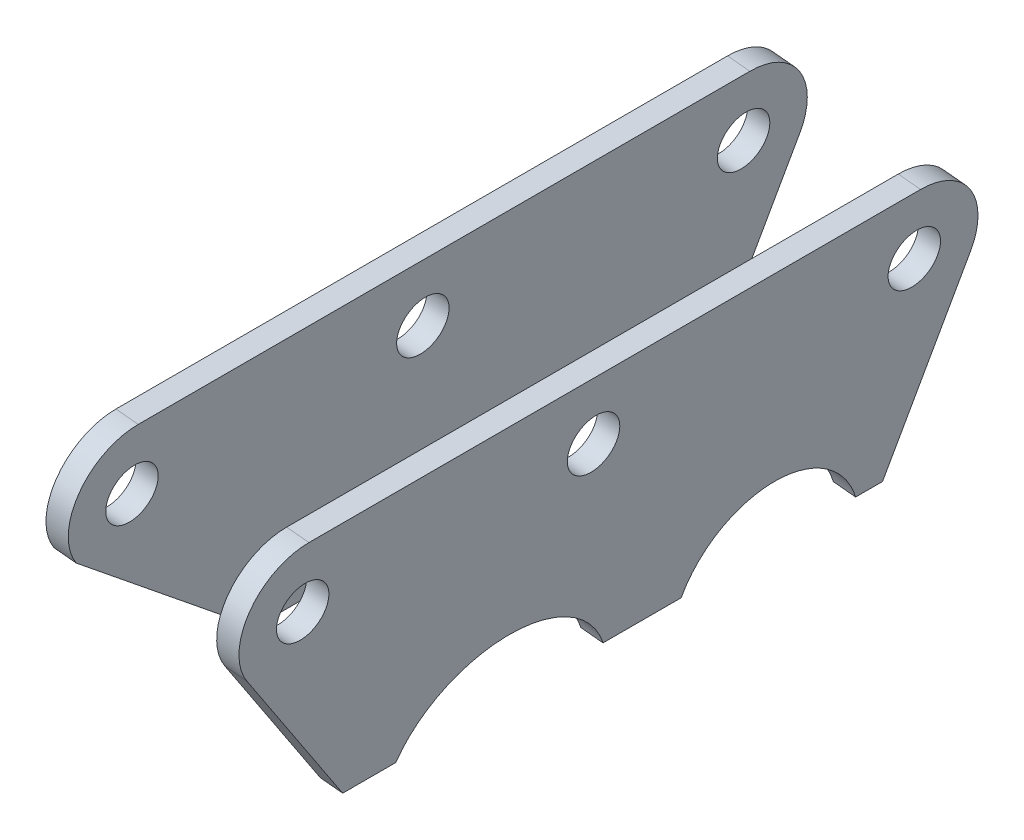
ISO-10303-21;
HEADER;
FILE_DESCRIPTION(('STEP AP214'),'2;1');
FILE_NAME('part.step','',(''),(''),'','','');
FILE_SCHEMA(('AUTOMOTIVE_DESIGN { 1 0 10303 214 1 1 1 1 }'));
ENDSEC;
DATA;
#1=APPLICATION_CONTEXT('core data for automotive mechanical design processes');
#2=APPLICATION_PROTOCOL_DEFINITION('international standard','automotive_design',2000,#1);
#3=PRODUCT_CONTEXT('',#1,'mechanical');
#4=PRODUCT('Part','Part','',(#3));
#5=PRODUCT_RELATED_PRODUCT_CATEGORY('part','',(#4));
#6=PRODUCT_DEFINITION_FORMATION('','',#4);
#7=PRODUCT_DEFINITION_CONTEXT('part definition',#1,'design');
#8=PRODUCT_DEFINITION('design','',#6,#7);
#9=PRODUCT_DEFINITION_SHAPE('','',#8);
#10=(LENGTH_UNIT() NAMED_UNIT(*) SI_UNIT(.MILLI.,.METRE.));
#11=(NAMED_UNIT(*) PLANE_ANGLE_UNIT() SI_UNIT($,.RADIAN.));
#12=(NAMED_UNIT(*) SI_UNIT($,.STERADIAN.) SOLID_ANGLE_UNIT());
#13=UNCERTAINTY_MEASURE_WITH_UNIT(LENGTH_MEASURE(1.E-05),#10,'distance_accuracy_value','');
#14=(GEOMETRIC_REPRESENTATION_CONTEXT(3) GLOBAL_UNCERTAINTY_ASSIGNED_CONTEXT((#13)) GLOBAL_UNIT_ASSIGNED_CONTEXT((#10,
#11,#12)) REPRESENTATION_CONTEXT('',''));
#15=CARTESIAN_POINT('',(0.,0.,0.));
#16=DIRECTION('',(0.,0.,1.));
#17=DIRECTION('',(1.,0.,0.));
#18=AXIS2_PLACEMENT_3D('',#15,#16,#17);
#19=CARTESIAN_POINT('',(1518.55335235882,195.979858268925,120.38052420687));
#20=CARTESIAN_POINT('',(1517.30151080177,183.389398509062,130.879563749731));
#21=CARTESIAN_POINT('',(1517.70411522621,187.438612865733,147.781567533865));
#22=CARTESIAN_POINT('',(1519.194517135,202.428405426136,147.2976885881));
#23=CARTESIAN_POINT('',(1520.68491904379,217.418197986539,146.813809642336));
#24=CARTESIAN_POINT('',(1521.16544153503,222.251077240006,129.62508687427));
#25=CARTESIAN_POINT('',(1519.95976976722,210.124972469999,119.923911954249));
#26=(BOUNDED_CURVE() B_SPLINE_CURVE(3,(#19,#20,#21,#22,#23,#24,#25),.UNSPECIFIED.,.F.,
.F.) B_SPLINE_CURVE_WITH_KNOTS((4,3,4),(0.,0.5,1.),
.UNSPECIFIED.) CURVE() GEOMETRIC_REPRESENTATION_ITEM() RATIONAL_B_SPLINE_CURVE((1.,
0.530847598998818,0.530847598998818,1.,0.530847598998818,0.530847598998818,1.)) REPRESENTATION_ITEM(''));
#27=DIRECTION('',(0.995093407225825,-0.098939935797927,0.));
#28=VECTOR('',#27,1.);
#29=SURFACE_OF_LINEAR_EXTRUSION('',#26,#28);
#30=CARTESIAN_POINT('',(1521.5386325805,195.683038461532,120.38052420687));
#31=CARTESIAN_POINT('',(1520.28679102345,183.092578701669,130.879563749731));
#32=CARTESIAN_POINT('',(1520.68939544789,187.141793058339,147.781567533865));
#33=CARTESIAN_POINT('',(1522.17979735668,202.131585618742,147.2976885881));
#34=CARTESIAN_POINT('',(1523.67019926546,217.121378179145,146.813809642336));
#35=CARTESIAN_POINT('',(1524.1507217567,221.954257432612,129.62508687427));
#36=CARTESIAN_POINT('',(1522.9450499889,209.828152662605,119.923911954249));
#37=(BOUNDED_CURVE() B_SPLINE_CURVE(3,(#30,#31,#32,#33,#34,#35,#36),.UNSPECIFIED.,.F.,
.F.) B_SPLINE_CURVE_WITH_KNOTS((4,3,4),(0.,0.5,1.),
.UNSPECIFIED.) CURVE() GEOMETRIC_REPRESENTATION_ITEM() RATIONAL_B_SPLINE_CURVE((1.,
0.530847598998818,0.530847598998818,1.,0.530847598998818,0.530847598998818,1.)) REPRESENTATION_ITEM(''));
#38=CARTESIAN_POINT('',(1522.4271576291,204.619424066495,146.921435672186));
#39=VERTEX_POINT('',#38);
#40=CARTESIAN_POINT('',(1522.9450499889,209.828152662605,119.923911954249));
#41=VERTEX_POINT('',#40);
#42=EDGE_CURVE('E158',#39,#41,#37,.T.);
#43=ORIENTED_EDGE('',*,*,#42,.F.);
#44=DIRECTION('',(0.995093407225825,-0.098939935797927,0.));
#45=VECTOR('',#44,1.);
#46=CARTESIAN_POINT('',(1519.44187740742,204.916243873889,146.921435672186));
#47=LINE('',#46,#45);
#48=CARTESIAN_POINT('',(1519.44187740742,204.916243873889,146.921435672186));
#49=VERTEX_POINT('',#48);
#50=EDGE_CURVE('E12',#49,#39,#47,.T.);
#51=ORIENTED_EDGE('',*,*,#50,.F.);
#52=CARTESIAN_POINT('',(1519.95976976722,210.124972469999,119.923911954249));
#53=VERTEX_POINT('',#52);
#54=EDGE_CURVE('E203',#49,#53,#26,.T.);
#55=ORIENTED_EDGE('',*,*,#54,.T.);
#56=DIRECTION('',(0.995093407225825,-0.098939935797927,0.));
#57=VECTOR('',#56,1.);
#58=CARTESIAN_POINT('',(1519.95976976722,210.124972469999,119.923911954249));
#59=LINE('',#58,#57);
#60=EDGE_CURVE('E50',#53,#41,#59,.T.);
#61=ORIENTED_EDGE('',*,*,#60,.T.);
#62=EDGE_LOOP('',(#43,#51,#55,#61));
#63=FACE_BOUND('',#62,.T.);
#64=ADVANCED_FACE('F46',(#63),#29,.T.);
#65=CARTESIAN_POINT('',(1519.44187740742,204.91624387389,2.06594070866154E-12));
#66=DIRECTION('',(-0.098939935797927,-0.995093407225825,0.));
#67=DIRECTION('',(0.995093407225825,-0.098939935797927,0.));
#68=AXIS2_PLACEMENT_3D('',#65,#66,#67);
#69=PLANE('',#68);
#70=DIRECTION('',(0.,0.,-1.));
#71=VECTOR('',#70,1.);
#72=CARTESIAN_POINT('',(1522.4271576291,204.619424066496,2.06612481674144E-12));
#73=LINE('',#72,#71);
#74=CARTESIAN_POINT('',(1522.4271576291,204.619424066495,156.840444695534));
#75=VERTEX_POINT('',#74);
#76=EDGE_CURVE('E189',#75,#39,#73,.T.);
#77=ORIENTED_EDGE('',*,*,#76,.F.);
#78=DIRECTION('',(0.995093407225825,-0.098939935797927,0.));
#79=VECTOR('',#78,1.);
#80=CARTESIAN_POINT('',(1519.44187740742,204.916243873889,156.840444695534));
#81=LINE('',#80,#79);
#82=CARTESIAN_POINT('',(1519.44187740742,204.916243873889,156.840444695534));
#83=VERTEX_POINT('',#82);
#84=EDGE_CURVE('E56',#83,#75,#81,.T.);
#85=ORIENTED_EDGE('',*,*,#84,.F.);
#86=DIRECTION('',(0.,0.,-1.));
#87=VECTOR('',#86,1.);
#88=CARTESIAN_POINT('',(1519.44187740742,204.91624387389,2.06594070866154E-12));
#89=LINE('',#88,#87);
#90=EDGE_CURVE('E130',#83,#49,#89,.T.);
#91=ORIENTED_EDGE('',*,*,#90,.T.);
#92=ORIENTED_EDGE('',*,*,#50,.T.);
#93=EDGE_LOOP('',(#77,#85,#91,#92));
#94=FACE_BOUND('',#93,.T.);
#95=ADVANCED_FACE('F207',(#94),#69,.T.);
#96=CARTESIAN_POINT('',(1497.55241578868,-15.2381232061701,-110.194750627851));
#97=DIRECTION('',(0.0761883832681866,0.766268517216435,-0.637987374309168));
#98=DIRECTION('',(0.,0.639847127682288,0.768502214178154));
#99=AXIS2_PLACEMENT_3D('',#96,#97,#98);
#100=PLANE('',#99);
#101=DIRECTION('',(0.0631224298540366,0.634857030068368,0.770046823395885));
#102=VECTOR('',#101,1.);
#103=CARTESIAN_POINT('',(1500.53769601036,-15.5349430135639,-110.194750627851));
#104=LINE('',#103,#102);
#105=CARTESIAN_POINT('',(1524.57087184271,226.179938167708,182.992168009732));
#106=VERTEX_POINT('',#105);
#107=EDGE_CURVE('E134',#75,#106,#104,.T.);
#108=ORIENTED_EDGE('',*,*,#107,.T.);
#109=DIRECTION('',(0.995093407225825,-0.098939935797927,0.));
#110=VECTOR('',#109,1.);
#111=CARTESIAN_POINT('',(1521.58559162104,226.476757975102,182.992168009732));
#112=LINE('',#111,#110);
#113=CARTESIAN_POINT('',(1521.58559162104,226.476757975102,182.992168009732));
#114=VERTEX_POINT('',#113);
#115=EDGE_CURVE('E132',#114,#106,#112,.T.);
#116=ORIENTED_EDGE('',*,*,#115,.F.);
#117=DIRECTION('',(0.0631224298540366,0.634857030068368,0.770046823395885));
#118=VECTOR('',#117,1.);
#119=CARTESIAN_POINT('',(1497.55241578868,-15.2381232061701,-110.194750627851));
#120=LINE('',#119,#118);
#121=EDGE_CURVE('E125',#83,#114,#120,.T.);
#122=ORIENTED_EDGE('',*,*,#121,.F.);
#123=ORIENTED_EDGE('',*,*,#84,.T.);
#124=EDGE_LOOP('',(#108,#116,#122,#123));
#125=FACE_BOUND('',#124,.T.);
#126=ADVANCED_FACE('F133',(#125),#100,.F.);
#127=CARTESIAN_POINT('',(1522.06378570607,231.286219165373,176.));
#128=DIRECTION('',(0.995093407225825,-0.098939935797927,0.));
#129=DIRECTION('',(0.098939935797927,0.995093407225825,0.));
#130=AXIS2_PLACEMENT_3D('',#127,#128,#129);
#131=CYLINDRICAL_SURFACE('',#130,8.50000000000009);
#132=CARTESIAN_POINT('',(1525.04906592774,230.989399357979,176.));
#133=DIRECTION('',(0.995093407225826,-0.0989399357979263,0.));
#134=DIRECTION('',(0.0989399357979263,0.995093407225826,0.));
#135=AXIS2_PLACEMENT_3D('',#132,#133,#134);
#136=CIRCLE('',#135,8.50000000000009);
#137=CARTESIAN_POINT('',(1525.89005538203,239.447693319399,176.));
#138=VERTEX_POINT('',#137);
#139=EDGE_CURVE('E186',#138,#106,#136,.T.);
#140=ORIENTED_EDGE('',*,*,#139,.F.);
#141=DIRECTION('',(0.995093407225825,-0.098939935797927,0.));
#142=VECTOR('',#141,1.);
#143=CARTESIAN_POINT('',(1522.90477516035,239.744513126793,176.));
#144=LINE('',#143,#142);
#145=CARTESIAN_POINT('',(1522.90477516035,239.744513126793,176.));
#146=VERTEX_POINT('',#145);
#147=EDGE_CURVE('E138',#146,#138,#144,.T.);
#148=ORIENTED_EDGE('',*,*,#147,.F.);
#149=CARTESIAN_POINT('',(1522.06378570607,231.286219165373,176.));
#150=DIRECTION('',(0.995093407225826,-0.0989399357979263,0.));
#151=DIRECTION('',(0.0989399357979263,0.995093407225826,0.));
#152=AXIS2_PLACEMENT_3D('',#149,#150,#151);
#153=CIRCLE('',#152,8.50000000000009);
#154=EDGE_CURVE('E129',#146,#114,#153,.T.);
#155=ORIENTED_EDGE('',*,*,#154,.T.);
#156=ORIENTED_EDGE('',*,*,#115,.T.);
#157=EDGE_LOOP('',(#140,#148,#155,#156));
#158=FACE_BOUND('',#157,.T.);
#159=ADVANCED_FACE('F140',(#158),#131,.T.);
#160=CARTESIAN_POINT('',(1522.90477516035,239.744513126793,3.55372683172558E-13));
#161=DIRECTION('',(-0.098939935797927,-0.995093407225825,0.));
#162=DIRECTION('',(0.995093407225825,-0.098939935797927,0.));
#163=AXIS2_PLACEMENT_3D('',#160,#161,#162);
#164=PLANE('',#163);
#165=DIRECTION('',(0.,0.,-1.));
#166=VECTOR('',#165,1.);
#167=CARTESIAN_POINT('',(1525.89005538203,239.447693319399,3.55556791252454E-13));
#168=LINE('',#167,#166);
#169=CARTESIAN_POINT('',(1525.89005538203,239.447693319399,94.));
#170=VERTEX_POINT('',#169);
#171=EDGE_CURVE('E183',#138,#170,#168,.T.);
#172=ORIENTED_EDGE('',*,*,#171,.T.);
#173=DIRECTION('',(0.995093407225825,-0.098939935797927,0.));
#174=VECTOR('',#173,1.);
#175=CARTESIAN_POINT('',(1522.90477516035,239.744513126793,94.));
#176=LINE('',#175,#174);
#177=CARTESIAN_POINT('',(1522.90477516035,239.744513126793,94.));
#178=VERTEX_POINT('',#177);
#179=EDGE_CURVE('E195',#178,#170,#176,.T.);
#180=ORIENTED_EDGE('',*,*,#179,.F.);
#181=DIRECTION('',(0.,0.,-1.));
#182=VECTOR('',#181,1.);
#183=CARTESIAN_POINT('',(1522.90477516035,239.744513126793,3.55372683172558E-13));
#184=LINE('',#183,#182);
#185=EDGE_CURVE('E142',#146,#178,#184,.T.);
#186=ORIENTED_EDGE('',*,*,#185,.F.);
#187=ORIENTED_EDGE('',*,*,#147,.T.);
#188=EDGE_LOOP('',(#172,#180,#186,#187));
#189=FACE_BOUND('',#188,.T.);
#190=ADVANCED_FACE('F221',(#189),#164,.F.);
#191=CARTESIAN_POINT('',(1522.06378570607,231.286219165373,94.));
#192=DIRECTION('',(0.995093407225825,-0.098939935797927,0.));
#193=DIRECTION('',(0.098939935797927,0.995093407225825,0.));
#194=AXIS2_PLACEMENT_3D('',#191,#192,#193);
#195=CYLINDRICAL_SURFACE('',#194,8.50000000000013);
#196=CARTESIAN_POINT('',(1525.04906592774,230.989399357979,94.));
#197=DIRECTION('',(0.995093407225826,-0.0989399357979263,0.));
#198=DIRECTION('',(0.0989399357979263,0.995093407225826,0.));
#199=AXIS2_PLACEMENT_3D('',#196,#197,#198);
#200=CIRCLE('',#199,8.50000000000013);
#201=CARTESIAN_POINT('',(1524.73132954661,227.79374963824,86.1300021308239));
#202=VERTEX_POINT('',#201);
#203=EDGE_CURVE('E180',#202,#170,#200,.T.);
#204=ORIENTED_EDGE('',*,*,#203,.F.);
#205=DIRECTION('',(0.995093407225825,-0.098939935797927,0.));
#206=VECTOR('',#205,1.);
#207=CARTESIAN_POINT('',(1521.74604932493,228.090569445634,86.1300021308239));
#208=LINE('',#207,#206);
#209=CARTESIAN_POINT('',(1521.74604932493,228.090569445634,86.1300021308239));
#210=VERTEX_POINT('',#209);
#211=EDGE_CURVE('E197',#210,#202,#208,.T.);
#212=ORIENTED_EDGE('',*,*,#211,.F.);
#213=CARTESIAN_POINT('',(1522.06378570607,231.286219165373,94.));
#214=DIRECTION('',(0.995093407225826,-0.0989399357979263,0.));
#215=DIRECTION('',(0.0989399357979263,0.995093407225826,0.));
#216=AXIS2_PLACEMENT_3D('',#213,#214,#215);
#217=CIRCLE('',#216,8.50000000000013);
#218=EDGE_CURVE('E144',#210,#178,#217,.T.);
#219=ORIENTED_EDGE('',*,*,#218,.T.);
#220=ORIENTED_EDGE('',*,*,#179,.T.);
#221=EDGE_LOOP('',(#204,#212,#219,#220));
#222=FACE_BOUND('',#221,.T.);
#223=ADVANCED_FACE('F224',(#222),#195,.T.);
#224=CARTESIAN_POINT('',(1492.70581002479,-63.983105747075,205.900339363962));
#225=DIRECTION('',(0.0373807507218143,0.375958790557542,0.925882102255997));
#226=DIRECTION('',(0.,-0.92652965799966,0.376221733618665));
#227=AXIS2_PLACEMENT_3D('',#224,#225,#226);
#228=PLANE('',#227);
#229=DIRECTION('',(-0.0916067157536574,-0.92133917582333,0.377812562948899));
#230=VECTOR('',#229,1.);
#231=CARTESIAN_POINT('',(1495.69109024647,-64.2799255544688,205.900339363962));
#232=LINE('',#231,#230);
#233=CARTESIAN_POINT('',(1522.4271576291,204.619424066495,95.6330728442222));
#234=VERTEX_POINT('',#233);
#235=EDGE_CURVE('E177',#202,#234,#232,.T.);
#236=ORIENTED_EDGE('',*,*,#235,.T.);
#237=DIRECTION('',(0.995093407225825,-0.098939935797927,0.));
#238=VECTOR('',#237,1.);
#239=CARTESIAN_POINT('',(1519.44187740742,204.916243873889,95.6330728442222));
#240=LINE('',#239,#238);
#241=CARTESIAN_POINT('',(1519.44187740742,204.916243873889,95.6330728442222));
#242=VERTEX_POINT('',#241);
#243=EDGE_CURVE('E199',#242,#234,#240,.T.);
#244=ORIENTED_EDGE('',*,*,#243,.F.);
#245=DIRECTION('',(-0.0916067157536574,-0.92133917582333,0.377812562948899));
#246=VECTOR('',#245,1.);
#247=CARTESIAN_POINT('',(1492.70581002479,-63.983105747075,205.900339363962));
#248=LINE('',#247,#246);
#249=EDGE_CURVE('E256',#210,#242,#248,.T.);
#250=ORIENTED_EDGE('',*,*,#249,.F.);
#251=ORIENTED_EDGE('',*,*,#211,.T.);
#252=EDGE_LOOP('',(#236,#244,#250,#251));
#253=FACE_BOUND('',#252,.T.);
#254=ADVANCED_FACE('F228',(#253),#228,.F.);
#255=CARTESIAN_POINT('',(1519.44187740742,204.916243873889,0.));
#256=DIRECTION('',(0.098939935797927,0.995093407225825,0.));
#257=DIRECTION('',(-0.995093407225825,0.098939935797927,0.));
#258=AXIS2_PLACEMENT_3D('',#255,#256,#257);
#259=PLANE('',#258);
#260=DIRECTION('',(0.,0.,1.));
#261=VECTOR('',#260,1.);
#262=CARTESIAN_POINT('',(1522.4271576291,204.619424066495,0.));
#263=LINE('',#262,#261);
#264=CARTESIAN_POINT('',(1522.4271576291,204.619424066495,97.5003622877248));
#265=VERTEX_POINT('',#264);
#266=EDGE_CURVE('E171',#234,#265,#263,.T.);
#267=ORIENTED_EDGE('',*,*,#266,.T.);
#268=DIRECTION('',(0.995093407225825,-0.098939935797927,0.));
#269=VECTOR('',#268,1.);
#270=CARTESIAN_POINT('',(1519.44187740742,204.916243873889,97.5003622877248));
#271=LINE('',#270,#269);
#272=CARTESIAN_POINT('',(1519.44187740742,204.916243873889,97.5003622877248));
#273=VERTEX_POINT('',#272);
#274=EDGE_CURVE('E201',#273,#265,#271,.T.);
#275=ORIENTED_EDGE('',*,*,#274,.F.);
#276=DIRECTION('',(0.,0.,1.));
#277=VECTOR('',#276,1.);
#278=CARTESIAN_POINT('',(1519.44187740742,204.916243873889,0.));
#279=LINE('',#278,#277);
#280=EDGE_CURVE('E247',#242,#273,#279,.T.);
#281=ORIENTED_EDGE('',*,*,#280,.F.);
#282=ORIENTED_EDGE('',*,*,#243,.T.);
#283=EDGE_LOOP('',(#267,#275,#281,#282));
#284=FACE_BOUND('',#283,.T.);
#285=ADVANCED_FACE('F232',(#284),#259,.F.);
#286=CARTESIAN_POINT('',(1522.06378570607,231.286219165373,94.));
#287=DIRECTION('',(0.995093407225825,-0.098939935797927,0.));
#288=DIRECTION('',(0.098939935797927,0.995093407225825,0.));
#289=AXIS2_PLACEMENT_3D('',#286,#287,#288);
#290=CYLINDRICAL_SURFACE('',#289,3.50000000000002);
#291=CARTESIAN_POINT('',(1522.06378570607,231.286219165373,94.));
#292=DIRECTION('',(0.995093407225826,-0.0989399357979263,0.));
#293=DIRECTION('',(0.0989399357979263,0.995093407225826,0.));
#294=AXIS2_PLACEMENT_3D('',#291,#292,#293);
#295=CIRCLE('',#294,3.50000000000002);
#296=CARTESIAN_POINT('',(1522.41007548136,234.769046090664,94.));
#297=VERTEX_POINT('',#296);
#298=EDGE_CURVE('E266',#297,#297,#295,.T.);
#299=ORIENTED_EDGE('',*,*,#298,.F.);
#300=EDGE_LOOP('',(#299));
#301=FACE_BOUND('',#300,.T.);
#302=CARTESIAN_POINT('',(1525.04906592774,230.989399357979,94.));
#303=DIRECTION('',(0.995093407225826,-0.0989399357979263,0.));
#304=DIRECTION('',(0.0989399357979263,0.995093407225826,0.));
#305=AXIS2_PLACEMENT_3D('',#302,#303,#304);
#306=CIRCLE('',#305,3.50000000000002);
#307=CARTESIAN_POINT('',(1525.39535570304,234.47222628327,94.));
#308=VERTEX_POINT('',#307);
#309=EDGE_CURVE('E155',#308,#308,#306,.T.);
#310=ORIENTED_EDGE('',*,*,#309,.T.);
#311=EDGE_LOOP('',(#310));
#312=FACE_BOUND('',#311,.T.);
#313=ADVANCED_FACE('F236',(#301,#312),#290,.F.);
#314=CARTESIAN_POINT('',(1522.06378570607,231.286219165373,137.));
#315=DIRECTION('',(0.995093407225825,-0.098939935797927,0.));
#316=DIRECTION('',(0.098939935797927,0.995093407225825,0.));
#317=AXIS2_PLACEMENT_3D('',#314,#315,#316);
#318=CYLINDRICAL_SURFACE('',#317,3.49999999999995);
#319=CARTESIAN_POINT('',(1522.06378570607,231.286219165373,137.));
#320=DIRECTION('',(0.995093407225826,-0.0989399357979263,0.));
#321=DIRECTION('',(0.0989399357979263,0.995093407225826,0.));
#322=AXIS2_PLACEMENT_3D('',#319,#320,#321);
#323=CIRCLE('',#322,3.49999999999995);
#324=CARTESIAN_POINT('',(1522.41007548136,234.769046090663,137.));
#325=VERTEX_POINT('',#324);
#326=EDGE_CURVE('E268',#325,#325,#323,.T.);
#327=ORIENTED_EDGE('',*,*,#326,.F.);
#328=EDGE_LOOP('',(#327));
#329=FACE_BOUND('',#328,.T.);
#330=CARTESIAN_POINT('',(1525.04906592774,230.989399357979,137.));
#331=DIRECTION('',(0.995093407225826,-0.0989399357979263,0.));
#332=DIRECTION('',(0.0989399357979263,0.995093407225826,0.));
#333=AXIS2_PLACEMENT_3D('',#330,#331,#332);
#334=CIRCLE('',#333,3.49999999999995);
#335=CARTESIAN_POINT('',(1525.39535570304,234.47222628327,137.));
#336=VERTEX_POINT('',#335);
#337=EDGE_CURVE('E152',#336,#336,#334,.T.);
#338=ORIENTED_EDGE('',*,*,#337,.T.);
#339=EDGE_LOOP('',(#338));
#340=FACE_BOUND('',#339,.T.);
#341=ADVANCED_FACE('F281',(#329,#340),#318,.F.);
#342=CARTESIAN_POINT('',(1522.06378570607,231.286219165373,176.));
#343=DIRECTION('',(0.995093407225825,-0.098939935797927,0.));
#344=DIRECTION('',(0.098939935797927,0.995093407225825,0.));
#345=AXIS2_PLACEMENT_3D('',#342,#343,#344);
#346=CYLINDRICAL_SURFACE('',#345,3.50000000000001);
#347=CARTESIAN_POINT('',(1522.06378570607,231.286219165373,176.));
#348=DIRECTION('',(0.995093407225826,-0.0989399357979263,0.));
#349=DIRECTION('',(0.0989399357979263,0.995093407225826,0.));
#350=AXIS2_PLACEMENT_3D('',#347,#348,#349);
#351=CIRCLE('',#350,3.50000000000001);
#352=CARTESIAN_POINT('',(1522.41007548136,234.769046090664,176.));
#353=VERTEX_POINT('',#352);
#354=EDGE_CURVE('E191',#353,#353,#351,.T.);
#355=ORIENTED_EDGE('',*,*,#354,.F.);
#356=EDGE_LOOP('',(#355));
#357=FACE_BOUND('',#356,.T.);
#358=CARTESIAN_POINT('',(1525.04906592774,230.989399357979,176.));
#359=DIRECTION('',(0.995093407225826,-0.0989399357979263,0.));
#360=DIRECTION('',(0.0989399357979263,0.995093407225826,0.));
#361=AXIS2_PLACEMENT_3D('',#358,#359,#360);
#362=CIRCLE('',#361,3.50000000000001);
#363=CARTESIAN_POINT('',(1525.39535570304,234.47222628327,176.));
#364=VERTEX_POINT('',#363);
#365=EDGE_CURVE('E149',#364,#364,#362,.T.);
#366=ORIENTED_EDGE('',*,*,#365,.T.);
#367=EDGE_LOOP('',(#366));
#368=FACE_BOUND('',#367,.T.);
#369=ADVANCED_FACE('F48',(#357,#368),#346,.F.);
#370=CARTESIAN_POINT('',(1520.34904504979,214.04012830831,104.367455980157));
#371=CARTESIAN_POINT('',(1519.2729031872,203.216777109725,81.8575251156769));
#372=CARTESIAN_POINT('',(1517.03186133056,180.677385317426,92.8021803263716));
#373=CARTESIAN_POINT('',(1518.10800319316,191.500736516011,115.312111190851));
#374=CARTESIAN_POINT('',(1519.18414505575,202.324087714596,137.822042055331));
#375=CARTESIAN_POINT('',(1521.42518691238,224.863479506895,126.877386844636));
#376=CARTESIAN_POINT('',(1520.34904504979,214.04012830831,104.367455980157));
#377=(BOUNDED_CURVE() B_SPLINE_CURVE(3,(#370,#371,#372,#373,#374,#375,#376),.UNSPECIFIED.,.T.,
.F.) B_SPLINE_CURVE_WITH_KNOTS((4,3,4),(0.,0.5,1.),
.UNSPECIFIED.) CURVE() GEOMETRIC_REPRESENTATION_ITEM() RATIONAL_B_SPLINE_CURVE((1.,
0.333333333333333,0.333333333333333,1.,0.333333333333333,0.333333333333333,1.)) REPRESENTATION_ITEM(''));
#378=DIRECTION('',(0.995093407225825,-0.098939935797927,0.));
#379=VECTOR('',#378,1.);
#380=SURFACE_OF_LINEAR_EXTRUSION('',#377,#379);
#381=CARTESIAN_POINT('',(1523.33432527147,213.743308500916,104.367455980157));
#382=CARTESIAN_POINT('',(1522.25818340887,202.919957302331,81.8575251156769));
#383=CARTESIAN_POINT('',(1520.01714155224,180.380565510032,92.8021803263716));
#384=CARTESIAN_POINT('',(1521.09328341483,191.203916708617,115.312111190851));
#385=CARTESIAN_POINT('',(1522.16942527743,202.027267907202,137.822042055331));
#386=CARTESIAN_POINT('',(1524.41046713406,224.566659699501,126.877386844636));
#387=CARTESIAN_POINT('',(1523.33432527147,213.743308500916,104.367455980157));
#388=(BOUNDED_CURVE() B_SPLINE_CURVE(3,(#381,#382,#383,#384,#385,#386,#387),.UNSPECIFIED.,.T.,
.F.) B_SPLINE_CURVE_WITH_KNOTS((4,3,4),(0.,0.5,1.),
.UNSPECIFIED.) CURVE() GEOMETRIC_REPRESENTATION_ITEM() RATIONAL_B_SPLINE_CURVE((1.,
0.333333333333333,0.333333333333333,1.,0.333333333333333,0.333333333333333,1.)) REPRESENTATION_ITEM(''));
#389=EDGE_CURVE('E163',#41,#265,#388,.T.);
#390=ORIENTED_EDGE('',*,*,#389,.F.);
#391=ORIENTED_EDGE('',*,*,#60,.F.);
#392=EDGE_CURVE('E242',#53,#273,#377,.T.);
#393=ORIENTED_EDGE('',*,*,#392,.T.);
#394=ORIENTED_EDGE('',*,*,#274,.T.);
#395=EDGE_LOOP('',(#390,#391,#393,#394));
#396=FACE_BOUND('',#395,.T.);
#397=ADVANCED_FACE('F204',(#396),#380,.T.);
#398=CARTESIAN_POINT('',(1484.39297058168,-147.589908788246,0.));
#399=DIRECTION('',(0.995093407225826,-0.0989399357979263,0.));
#400=DIRECTION('',(0.0989399357979263,0.995093407225826,0.));
#401=AXIS2_PLACEMENT_3D('',#398,#399,#400);
#402=PLANE('',#401);
#403=ORIENTED_EDGE('',*,*,#354,.T.);
#404=EDGE_LOOP('',(#403));
#405=FACE_BOUND('',#404,.T.);
#406=ORIENTED_EDGE('',*,*,#326,.T.);
#407=EDGE_LOOP('',(#406));
#408=FACE_BOUND('',#407,.T.);
#409=ORIENTED_EDGE('',*,*,#298,.T.);
#410=EDGE_LOOP('',(#409));
#411=FACE_BOUND('',#410,.T.);
#412=ORIENTED_EDGE('',*,*,#54,.F.);
#413=ORIENTED_EDGE('',*,*,#90,.F.);
#414=ORIENTED_EDGE('',*,*,#121,.T.);
#415=ORIENTED_EDGE('',*,*,#154,.F.);
#416=ORIENTED_EDGE('',*,*,#185,.T.);
#417=ORIENTED_EDGE('',*,*,#218,.F.);
#418=ORIENTED_EDGE('',*,*,#249,.T.);
#419=ORIENTED_EDGE('',*,*,#280,.T.);
#420=ORIENTED_EDGE('',*,*,#392,.F.);
#421=EDGE_LOOP('',(#412,#413,#414,#415,#416,#417,#418,#419,#420));
#422=FACE_BOUND('',#421,.T.);
#423=ADVANCED_FACE('F127',(#405,#408,#411,#422),#402,.F.);
#424=CARTESIAN_POINT('',(1487.37825080336,-147.88672859564,0.));
#425=DIRECTION('',(0.995093407225826,-0.0989399357979263,0.));
#426=DIRECTION('',(0.0989399357979263,0.995093407225826,0.));
#427=AXIS2_PLACEMENT_3D('',#424,#425,#426);
#428=PLANE('',#427);
#429=ORIENTED_EDGE('',*,*,#365,.F.);
#430=EDGE_LOOP('',(#429));
#431=FACE_BOUND('',#430,.T.);
#432=ORIENTED_EDGE('',*,*,#337,.F.);
#433=EDGE_LOOP('',(#432));
#434=FACE_BOUND('',#433,.T.);
#435=ORIENTED_EDGE('',*,*,#309,.F.);
#436=EDGE_LOOP('',(#435));
#437=FACE_BOUND('',#436,.T.);
#438=ORIENTED_EDGE('',*,*,#42,.T.);
#439=ORIENTED_EDGE('',*,*,#389,.T.);
#440=ORIENTED_EDGE('',*,*,#266,.F.);
#441=ORIENTED_EDGE('',*,*,#235,.F.);
#442=ORIENTED_EDGE('',*,*,#203,.T.);
#443=ORIENTED_EDGE('',*,*,#171,.F.);
#444=ORIENTED_EDGE('',*,*,#139,.T.);
#445=ORIENTED_EDGE('',*,*,#107,.F.);
#446=ORIENTED_EDGE('',*,*,#76,.T.);
#447=EDGE_LOOP('',(#438,#439,#440,#441,#442,#443,#444,#445,#446));
#448=FACE_BOUND('',#447,.T.);
#449=ADVANCED_FACE('F206',(#431,#434,#437,#448),#428,.T.);
#450=CLOSED_SHELL('',(#64,#95,#126,#159,#190,#223,#254,#285,#313,#341,#369,#397,#423,#449));
#451=MANIFOLD_SOLID_BREP('B2',#450);
#452=CARTESIAN_POINT('',(1542.32902577361,202.640625350536,-3.60533750706417E-12));
#453=DIRECTION('',(-0.098939935797927,-0.995093407225825,0.));
#454=DIRECTION('',(0.995093407225825,-0.098939935797927,0.));
#455=AXIS2_PLACEMENT_3D('',#452,#453,#454);
#456=PLANE('',#455);
#457=DIRECTION('',(0.,0.,-1.));
#458=VECTOR('',#457,1.);
#459=CARTESIAN_POINT('',(1545.31430599529,202.343805543142,-3.60515339898427E-12));
#460=LINE('',#459,#458);
#461=CARTESIAN_POINT('',(1545.31430599529,202.343805543143,133.110394171571));
#462=VERTEX_POINT('',#461);
#463=CARTESIAN_POINT('',(1545.31430599529,202.343805543143,122.632192473028));
#464=VERTEX_POINT('',#463);
#465=EDGE_CURVE('E591',#462,#464,#460,.T.);
#466=ORIENTED_EDGE('',*,*,#465,.F.);
#467=DIRECTION('',(0.995093407225825,-0.098939935797927,0.));
#468=VECTOR('',#467,1.);
#469=CARTESIAN_POINT('',(1542.32902577362,202.640625350536,133.110394171571));
#470=LINE('',#469,#468);
#471=CARTESIAN_POINT('',(1542.32902577362,202.640625350536,133.110394171571));
#472=VERTEX_POINT('',#471);
#473=EDGE_CURVE('E44',#472,#462,#470,.T.);
#474=ORIENTED_EDGE('',*,*,#473,.F.);
#475=DIRECTION('',(0.,0.,-1.));
#476=VECTOR('',#475,1.);
#477=CARTESIAN_POINT('',(1542.32902577361,202.640625350536,-3.60533750706417E-12));
#478=LINE('',#477,#476);
#479=CARTESIAN_POINT('',(1542.32902577362,202.640625350536,122.632192473028));
#480=VERTEX_POINT('',#479);
#481=EDGE_CURVE('E549',#472,#480,#478,.T.);
#482=ORIENTED_EDGE('',*,*,#481,.T.);
#483=DIRECTION('',(0.995093407225825,-0.098939935797927,0.));
#484=VECTOR('',#483,1.);
#485=CARTESIAN_POINT('',(1542.32902577362,202.640625350536,122.632192473028));
#486=LINE('',#485,#484);
#487=EDGE_CURVE('E391',#480,#464,#486,.T.);
#488=ORIENTED_EDGE('',*,*,#487,.T.);
#489=EDGE_LOOP('',(#466,#474,#482,#488));
#490=FACE_BOUND('',#489,.T.);
#491=ADVANCED_FACE('F387',(#490),#456,.T.);
#492=CARTESIAN_POINT('',(1541.65861514551,195.897936558814,162.04562510747));
#493=CARTESIAN_POINT('',(1544.10258230726,220.478259868286,165.897213158411));
#494=CARTESIAN_POINT('',(1544.5579661277,225.058305668986,136.379012314273));
#495=CARTESIAN_POINT('',(1542.11399896595,200.477982359515,132.527424263332));
#496=CARTESIAN_POINT('',(1539.6700318042,175.897659050043,128.675836212392));
#497=CARTESIAN_POINT('',(1539.21464798377,171.317613249343,158.194037056529));
#498=CARTESIAN_POINT('',(1541.65861514551,195.897936558814,162.04562510747));
#499=(BOUNDED_CURVE() B_SPLINE_CURVE(3,(#492,#493,#494,#495,#496,#497,#498),.UNSPECIFIED.,.T.,
.F.) B_SPLINE_CURVE_WITH_KNOTS((4,3,4),(0.,0.5,1.),
.UNSPECIFIED.) CURVE() GEOMETRIC_REPRESENTATION_ITEM() RATIONAL_B_SPLINE_CURVE((1.,
0.333333333333333,0.333333333333333,1.,0.333333333333333,0.333333333333333,1.)) REPRESENTATION_ITEM(''));
#500=DIRECTION('',(0.995093407225825,-0.098939935797927,0.));
#501=VECTOR('',#500,1.);
#502=SURFACE_OF_LINEAR_EXTRUSION('',#499,#501);
#503=CARTESIAN_POINT('',(1544.64389536719,195.60111675142,162.04562510747));
#504=CARTESIAN_POINT('',(1547.08786252894,220.181440060892,165.897213158411));
#505=CARTESIAN_POINT('',(1547.54324634937,224.761485861593,136.379012314273));
#506=CARTESIAN_POINT('',(1545.09927918763,200.181162552121,132.527424263332));
#507=CARTESIAN_POINT('',(1542.65531202588,175.60083924265,128.675836212392));
#508=CARTESIAN_POINT('',(1542.19992820544,171.020793441949,158.194037056529));
#509=CARTESIAN_POINT('',(1544.64389536719,195.60111675142,162.04562510747));
#510=(BOUNDED_CURVE() B_SPLINE_CURVE(3,(#503,#504,#505,#506,#507,#508,#509),.UNSPECIFIED.,.T.,
.F.) B_SPLINE_CURVE_WITH_KNOTS((4,3,4),(0.,0.5,1.),
.UNSPECIFIED.) CURVE() GEOMETRIC_REPRESENTATION_ITEM() RATIONAL_B_SPLINE_CURVE((1.,
0.333333333333333,0.333333333333333,1.,0.333333333333333,0.333333333333333,1.)) REPRESENTATION_ITEM(''));
#511=CARTESIAN_POINT('',(1545.31430599529,202.343805543143,160.885440505008));
#512=VERTEX_POINT('',#511);
#513=EDGE_CURVE('E611',#512,#462,#510,.T.);
#514=ORIENTED_EDGE('',*,*,#513,.F.);
#515=DIRECTION('',(0.995093407225825,-0.098939935797927,0.));
#516=VECTOR('',#515,1.);
#517=CARTESIAN_POINT('',(1542.32902577362,202.640625350536,160.885440505008));
#518=LINE('',#517,#516);
#519=CARTESIAN_POINT('',(1542.32902577362,202.640625350536,160.885440505008));
#520=VERTEX_POINT('',#519);
#521=EDGE_CURVE('E397',#520,#512,#518,.T.);
#522=ORIENTED_EDGE('',*,*,#521,.F.);
#523=EDGE_CURVE('E487',#520,#472,#499,.T.);
#524=ORIENTED_EDGE('',*,*,#523,.T.);
#525=ORIENTED_EDGE('',*,*,#473,.T.);
#526=EDGE_LOOP('',(#514,#522,#524,#525));
#527=FACE_BOUND('',#526,.T.);
#528=ADVANCED_FACE('F506',(#527),#502,.T.);
#529=CARTESIAN_POINT('',(1542.32902577361,202.640625350536,-1.7378393510497E-12));
#530=DIRECTION('',(-0.098939935797927,-0.995093407225825,0.));
#531=DIRECTION('',(0.995093407225825,-0.098939935797927,0.));
#532=AXIS2_PLACEMENT_3D('',#529,#530,#531);
#533=PLANE('',#532);
#534=DIRECTION('',(0.,0.,-1.));
#535=VECTOR('',#534,1.);
#536=CARTESIAN_POINT('',(1545.31430599529,202.343805543143,-1.7376552429698E-12));
#537=LINE('',#536,#535);
#538=CARTESIAN_POINT('',(1545.31430599529,202.343805543142,168.015473067151));
#539=VERTEX_POINT('',#538);
#540=EDGE_CURVE('E474',#539,#512,#537,.T.);
#541=ORIENTED_EDGE('',*,*,#540,.F.);
#542=DIRECTION('',(0.995093407225825,-0.098939935797927,0.));
#543=VECTOR('',#542,1.);
#544=CARTESIAN_POINT('',(1542.32902577362,202.640625350536,168.015473067151));
#545=LINE('',#544,#543);
#546=CARTESIAN_POINT('',(1542.32902577362,202.640625350536,168.015473067151));
#547=VERTEX_POINT('',#546);
#548=EDGE_CURVE('E469',#547,#539,#545,.T.);
#549=ORIENTED_EDGE('',*,*,#548,.F.);
#550=DIRECTION('',(0.,0.,-1.));
#551=VECTOR('',#550,1.);
#552=CARTESIAN_POINT('',(1542.32902577361,202.640625350536,-1.7378393510497E-12));
#553=LINE('',#552,#551);
#554=EDGE_CURVE('E472',#547,#520,#553,.T.);
#555=ORIENTED_EDGE('',*,*,#554,.T.);
#556=ORIENTED_EDGE('',*,*,#521,.T.);
#557=EDGE_LOOP('',(#541,#549,#555,#556));
#558=FACE_BOUND('',#557,.T.);
#559=ADVANCED_FACE('F471',(#558),#533,.T.);
#560=CARTESIAN_POINT('',(1510.83650908109,-114.096953716458,-52.0016413796223));
#561=DIRECTION('',(-0.0562581276506254,-0.565818963561315,0.822608001144922));
#562=DIRECTION('',(0.,-0.823912867037678,-0.56671649660986));
#563=AXIS2_PLACEMENT_3D('',#560,#561,#562);
#564=PLANE('',#563);
#565=DIRECTION('',(-0.08138878282014,-0.818571798670527,-0.568608895861079));
#566=VECTOR('',#565,1.);
#567=CARTESIAN_POINT('',(1513.82178930277,-114.393773523851,-52.0016413796223));
#568=LINE('',#567,#566);
#569=CARTESIAN_POINT('',(1547.45802020891,223.904319644356,182.992168009732));
#570=VERTEX_POINT('',#569);
#571=EDGE_CURVE('E608',#570,#539,#568,.T.);
#572=ORIENTED_EDGE('',*,*,#571,.F.);
#573=DIRECTION('',(0.995093407225825,-0.098939935797927,0.));
#574=VECTOR('',#573,1.);
#575=CARTESIAN_POINT('',(1544.47273998723,224.201139451749,182.992168009732));
#576=LINE('',#575,#574);
#577=CARTESIAN_POINT('',(1544.47273998723,224.201139451749,182.992168009732));
#578=VERTEX_POINT('',#577);
#579=EDGE_CURVE('E479',#578,#570,#576,.T.);
#580=ORIENTED_EDGE('',*,*,#579,.F.);
#581=DIRECTION('',(-0.08138878282014,-0.818571798670527,-0.568608895861079));
#582=VECTOR('',#581,1.);
#583=CARTESIAN_POINT('',(1510.83650908109,-114.096953716458,-52.0016413796223));
#584=LINE('',#583,#582);
#585=EDGE_CURVE('E485',#578,#547,#584,.T.);
#586=ORIENTED_EDGE('',*,*,#585,.T.);
#587=ORIENTED_EDGE('',*,*,#548,.T.);
#588=EDGE_LOOP('',(#572,#580,#586,#587));
#589=FACE_BOUND('',#588,.T.);
#590=ADVANCED_FACE('F489',(#589),#564,.T.);
#591=CARTESIAN_POINT('',(1544.95093407226,229.010600642021,176.));
#592=DIRECTION('',(0.995093407225825,-0.098939935797927,0.));
#593=DIRECTION('',(0.098939935797927,0.995093407225825,0.));
#594=AXIS2_PLACEMENT_3D('',#591,#592,#593);
#595=CYLINDRICAL_SURFACE('',#594,8.50000000000005);
#596=CARTESIAN_POINT('',(1547.93621429394,228.713780834627,176.));
#597=DIRECTION('',(0.995093407225825,-0.0989399357979265,0.));
#598=DIRECTION('',(0.0989399357979265,0.995093407225825,0.));
#599=AXIS2_PLACEMENT_3D('',#596,#597,#598);
#600=CIRCLE('',#599,8.50000000000005);
#601=CARTESIAN_POINT('',(1548.77720374822,237.172074796046,176.));
#602=VERTEX_POINT('',#601);
#603=EDGE_CURVE('E605',#602,#570,#600,.T.);
#604=ORIENTED_EDGE('',*,*,#603,.F.);
#605=DIRECTION('',(0.995093407225825,-0.098939935797927,0.));
#606=VECTOR('',#605,1.);
#607=CARTESIAN_POINT('',(1545.79192352654,237.46889460344,176.));
#608=LINE('',#607,#606);
#609=CARTESIAN_POINT('',(1545.79192352654,237.46889460344,176.));
#610=VERTEX_POINT('',#609);
#611=EDGE_CURVE('E569',#610,#602,#608,.T.);
#612=ORIENTED_EDGE('',*,*,#611,.F.);
#613=CARTESIAN_POINT('',(1544.95093407226,229.010600642021,176.));
#614=DIRECTION('',(0.995093407225825,-0.0989399357979265,0.));
#615=DIRECTION('',(0.0989399357979265,0.995093407225825,0.));
#616=AXIS2_PLACEMENT_3D('',#613,#614,#615);
#617=CIRCLE('',#616,8.50000000000005);
#618=EDGE_CURVE('E490',#610,#578,#617,.T.);
#619=ORIENTED_EDGE('',*,*,#618,.T.);
#620=ORIENTED_EDGE('',*,*,#579,.T.);
#621=EDGE_LOOP('',(#604,#612,#619,#620));
#622=FACE_BOUND('',#621,.T.);
#623=ADVANCED_FACE('F516',(#622),#595,.T.);
#624=CARTESIAN_POINT('',(1545.79192352654,237.46889460344,-1.47562740383021E-12));
#625=DIRECTION('',(-0.098939935797927,-0.995093407225825,0.));
#626=DIRECTION('',(0.995093407225825,-0.098939935797927,0.));
#627=AXIS2_PLACEMENT_3D('',#624,#625,#626);
#628=PLANE('',#627);
#629=DIRECTION('',(0.,0.,-1.));
#630=VECTOR('',#629,1.);
#631=CARTESIAN_POINT('',(1548.77720374822,237.172074796047,-1.47544329575032E-12));
#632=LINE('',#631,#630);
#633=CARTESIAN_POINT('',(1548.77720374822,237.172074796047,94.));
#634=VERTEX_POINT('',#633);
#635=EDGE_CURVE('E566',#602,#634,#632,.T.);
#636=ORIENTED_EDGE('',*,*,#635,.T.);
#637=DIRECTION('',(0.995093407225825,-0.098939935797927,0.));
#638=VECTOR('',#637,1.);
#639=CARTESIAN_POINT('',(1545.79192352654,237.46889460344,94.));
#640=LINE('',#639,#638);
#641=CARTESIAN_POINT('',(1545.79192352654,237.46889460344,94.));
#642=VERTEX_POINT('',#641);
#643=EDGE_CURVE('E564',#642,#634,#640,.T.);
#644=ORIENTED_EDGE('',*,*,#643,.F.);
#645=DIRECTION('',(0.,0.,-1.));
#646=VECTOR('',#645,1.);
#647=CARTESIAN_POINT('',(1545.79192352654,237.46889460344,-1.47562740383021E-12));
#648=LINE('',#647,#646);
#649=EDGE_CURVE('E492',#610,#642,#648,.T.);
#650=ORIENTED_EDGE('',*,*,#649,.F.);
#651=ORIENTED_EDGE('',*,*,#611,.T.);
#652=EDGE_LOOP('',(#636,#644,#650,#651));
#653=FACE_BOUND('',#652,.T.);
#654=ADVANCED_FACE('F519',(#653),#628,.F.);
#655=CARTESIAN_POINT('',(1544.95093407226,229.010600642021,94.));
#656=DIRECTION('',(0.995093407225825,-0.098939935797927,0.));
#657=DIRECTION('',(0.098939935797927,0.995093407225825,0.));
#658=AXIS2_PLACEMENT_3D('',#655,#656,#657);
#659=CYLINDRICAL_SURFACE('',#658,8.50000000000009);
#660=CARTESIAN_POINT('',(1547.93621429394,228.713780834627,94.));
#661=DIRECTION('',(0.995093407225825,-0.0989399357979265,0.));
#662=DIRECTION('',(0.0989399357979265,0.995093407225825,0.));
#663=AXIS2_PLACEMENT_3D('',#660,#661,#662);
#664=CIRCLE('',#663,8.50000000000009);
#665=CARTESIAN_POINT('',(1547.6184779128,225.518131114888,86.1300021308239));
#666=VERTEX_POINT('',#665);
#667=EDGE_CURVE('E573',#666,#634,#664,.T.);
#668=ORIENTED_EDGE('',*,*,#667,.F.);
#669=DIRECTION('',(0.995093407225825,-0.098939935797927,0.));
#670=VECTOR('',#669,1.);
#671=CARTESIAN_POINT('',(1544.63319769112,225.814950922282,86.1300021308239));
#672=LINE('',#671,#670);
#673=CARTESIAN_POINT('',(1544.63319769112,225.814950922282,86.1300021308239));
#674=VERTEX_POINT('',#673);
#675=EDGE_CURVE('E570',#674,#666,#672,.T.);
#676=ORIENTED_EDGE('',*,*,#675,.F.);
#677=CARTESIAN_POINT('',(1544.95093407226,229.010600642021,94.));
#678=DIRECTION('',(0.995093407225825,-0.0989399357979265,0.));
#679=DIRECTION('',(0.0989399357979265,0.995093407225825,0.));
#680=AXIS2_PLACEMENT_3D('',#677,#678,#679);
#681=CIRCLE('',#680,8.50000000000009);
#682=EDGE_CURVE('E558',#674,#642,#681,.T.);
#683=ORIENTED_EDGE('',*,*,#682,.T.);
#684=ORIENTED_EDGE('',*,*,#643,.T.);
#685=EDGE_LOOP('',(#668,#676,#683,#684));
#686=FACE_BOUND('',#685,.T.);
#687=ADVANCED_FACE('F523',(#686),#659,.T.);
#688=CARTESIAN_POINT('',(1515.59295839098,-66.2587242704336,205.900339363958));
#689=DIRECTION('',(0.0373807507218124,0.375958790557523,0.925882102256004));
#690=DIRECTION('',(0.,-0.926529657999667,0.376221733618646));
#691=AXIS2_PLACEMENT_3D('',#688,#689,#690);
#692=PLANE('',#691);
#693=DIRECTION('',(-0.0916067157536579,-0.921339175823337,0.377812562948881));
#694=VECTOR('',#693,1.);
#695=CARTESIAN_POINT('',(1518.57823861266,-66.5555440778274,205.900339363958));
#696=LINE('',#695,#694);
#697=CARTESIAN_POINT('',(1545.31430599529,202.343805543142,95.6330728442217));
#698=VERTEX_POINT('',#697);
#699=EDGE_CURVE('E588',#666,#698,#696,.T.);
#700=ORIENTED_EDGE('',*,*,#699,.T.);
#701=DIRECTION('',(0.995093407225825,-0.098939935797927,0.));
#702=VECTOR('',#701,1.);
#703=CARTESIAN_POINT('',(1542.32902577361,202.640625350536,95.6330728442217));
#704=LINE('',#703,#702);
#705=CARTESIAN_POINT('',(1542.32902577361,202.640625350536,95.6330728442217));
#706=VERTEX_POINT('',#705);
#707=EDGE_CURVE('E576',#706,#698,#704,.T.);
#708=ORIENTED_EDGE('',*,*,#707,.F.);
#709=DIRECTION('',(-0.0916067157536579,-0.921339175823337,0.377812562948881));
#710=VECTOR('',#709,1.);
#711=CARTESIAN_POINT('',(1515.59295839098,-66.2587242704336,205.900339363958));
#712=LINE('',#711,#710);
#713=EDGE_CURVE('E556',#674,#706,#712,.T.);
#714=ORIENTED_EDGE('',*,*,#713,.F.);
#715=ORIENTED_EDGE('',*,*,#675,.T.);
#716=EDGE_LOOP('',(#700,#708,#714,#715));
#717=FACE_BOUND('',#716,.T.);
#718=ADVANCED_FACE('F527',(#717),#692,.F.);
#719=CARTESIAN_POINT('',(1542.32902577362,202.640625350545,3.07749836499379E-11));
#720=DIRECTION('',(-0.098939935797927,-0.995093407225825,0.));
#721=DIRECTION('',(0.995093407225825,-0.098939935797927,0.));
#722=AXIS2_PLACEMENT_3D('',#719,#720,#721);
#723=PLANE('',#722);
#724=DIRECTION('',(0.,0.,-1.));
#725=VECTOR('',#724,1.);
#726=CARTESIAN_POINT('',(1545.31430599529,202.343805543151,3.07751677580178E-11));
#727=LINE('',#726,#725);
#728=CARTESIAN_POINT('',(1545.31430599529,202.343805543142,99.2442060300019));
#729=VERTEX_POINT('',#728);
#730=EDGE_CURVE('E586',#729,#698,#727,.T.);
#731=ORIENTED_EDGE('',*,*,#730,.F.);
#732=DIRECTION('',(0.995093407225825,-0.098939935797927,0.));
#733=VECTOR('',#732,1.);
#734=CARTESIAN_POINT('',(1542.32902577361,202.640625350536,99.2442060300019));
#735=LINE('',#734,#733);
#736=CARTESIAN_POINT('',(1542.32902577361,202.640625350536,99.2442060300019));
#737=VERTEX_POINT('',#736);
#738=EDGE_CURVE('E580',#737,#729,#735,.T.);
#739=ORIENTED_EDGE('',*,*,#738,.F.);
#740=DIRECTION('',(0.,0.,-1.));
#741=VECTOR('',#740,1.);
#742=CARTESIAN_POINT('',(1542.32902577362,202.640625350545,3.07749836499379E-11));
#743=LINE('',#742,#741);
#744=EDGE_CURVE('E548',#737,#706,#743,.T.);
#745=ORIENTED_EDGE('',*,*,#744,.T.);
#746=ORIENTED_EDGE('',*,*,#707,.T.);
#747=EDGE_LOOP('',(#731,#739,#745,#746));
#748=FACE_BOUND('',#747,.T.);
#749=ADVANCED_FACE('F531',(#748),#723,.T.);
#750=CARTESIAN_POINT('',(1544.95093407226,229.010600642021,94.));
#751=DIRECTION('',(0.995093407225825,-0.098939935797927,0.));
#752=DIRECTION('',(0.098939935797927,0.995093407225825,0.));
#753=AXIS2_PLACEMENT_3D('',#750,#751,#752);
#754=CYLINDRICAL_SURFACE('',#753,3.50000000000002);
#755=CARTESIAN_POINT('',(1544.95093407226,229.010600642021,94.));
#756=DIRECTION('',(0.995093407225825,-0.0989399357979265,0.));
#757=DIRECTION('',(0.0989399357979265,0.995093407225825,0.));
#758=AXIS2_PLACEMENT_3D('',#755,#756,#757);
#759=CIRCLE('',#758,3.50000000000002);
#760=CARTESIAN_POINT('',(1545.29722384755,232.493427567311,94.));
#761=VERTEX_POINT('',#760);
#762=EDGE_CURVE('E629',#761,#761,#759,.T.);
#763=ORIENTED_EDGE('',*,*,#762,.F.);
#764=EDGE_LOOP('',(#763));
#765=FACE_BOUND('',#764,.T.);
#766=CARTESIAN_POINT('',(1547.93621429394,228.713780834627,94.));
#767=DIRECTION('',(0.995093407225825,-0.0989399357979265,0.));
#768=DIRECTION('',(0.0989399357979265,0.995093407225825,0.));
#769=AXIS2_PLACEMENT_3D('',#766,#767,#768);
#770=CIRCLE('',#769,3.50000000000002);
#771=CARTESIAN_POINT('',(1548.28250406923,232.196607759917,94.));
#772=VERTEX_POINT('',#771);
#773=EDGE_CURVE('E593',#772,#772,#770,.T.);
#774=ORIENTED_EDGE('',*,*,#773,.T.);
#775=EDGE_LOOP('',(#774));
#776=FACE_BOUND('',#775,.T.);
#777=ADVANCED_FACE('F535',(#765,#776),#754,.F.);
#778=CARTESIAN_POINT('',(1544.95093407226,229.010600642021,137.));
#779=DIRECTION('',(0.995093407225825,-0.098939935797927,0.));
#780=DIRECTION('',(0.098939935797927,0.995093407225825,0.));
#781=AXIS2_PLACEMENT_3D('',#778,#779,#780);
#782=CYLINDRICAL_SURFACE('',#781,3.50000000000001);
#783=CARTESIAN_POINT('',(1544.95093407226,229.010600642021,137.));
#784=DIRECTION('',(0.995093407225825,-0.0989399357979265,0.));
#785=DIRECTION('',(0.0989399357979265,0.995093407225825,0.));
#786=AXIS2_PLACEMENT_3D('',#783,#784,#785);
#787=CIRCLE('',#786,3.50000000000001);
#788=CARTESIAN_POINT('',(1545.29722384755,232.493427567311,137.));
#789=VERTEX_POINT('',#788);
#790=EDGE_CURVE('E624',#789,#789,#787,.T.);
#791=ORIENTED_EDGE('',*,*,#790,.F.);
#792=EDGE_LOOP('',(#791));
#793=FACE_BOUND('',#792,.T.);
#794=CARTESIAN_POINT('',(1547.93621429394,228.713780834627,137.));
#795=DIRECTION('',(0.995093407225825,-0.0989399357979265,0.));
#796=DIRECTION('',(0.0989399357979265,0.995093407225825,0.));
#797=AXIS2_PLACEMENT_3D('',#794,#795,#796);
#798=CIRCLE('',#797,3.50000000000001);
#799=CARTESIAN_POINT('',(1548.28250406923,232.196607759917,137.));
#800=VERTEX_POINT('',#799);
#801=EDGE_CURVE('E744',#800,#800,#798,.T.);
#802=ORIENTED_EDGE('',*,*,#801,.T.);
#803=EDGE_LOOP('',(#802));
#804=FACE_BOUND('',#803,.T.);
#805=ADVANCED_FACE('F675',(#793,#804),#782,.F.);
#806=CARTESIAN_POINT('',(1544.95093407226,229.010600642021,176.));
#807=DIRECTION('',(0.995093407225825,-0.098939935797927,0.));
#808=DIRECTION('',(0.098939935797927,0.995093407225825,0.));
#809=AXIS2_PLACEMENT_3D('',#806,#807,#808);
#810=CYLINDRICAL_SURFACE('',#809,3.50000000000001);
#811=CARTESIAN_POINT('',(1544.95093407226,229.010600642021,176.));
#812=DIRECTION('',(0.995093407225825,-0.0989399357979265,0.));
#813=DIRECTION('',(0.0989399357979265,0.995093407225825,0.));
#814=AXIS2_PLACEMENT_3D('',#811,#812,#813);
#815=CIRCLE('',#814,3.50000000000001);
#816=CARTESIAN_POINT('',(1545.29722384755,232.493427567311,176.));
#817=VERTEX_POINT('',#816);
#818=EDGE_CURVE('E614',#817,#817,#815,.T.);
#819=ORIENTED_EDGE('',*,*,#818,.F.);
#820=EDGE_LOOP('',(#819));
#821=FACE_BOUND('',#820,.T.);
#822=CARTESIAN_POINT('',(1547.93621429394,228.713780834627,176.));
#823=DIRECTION('',(0.995093407225825,-0.0989399357979265,0.));
#824=DIRECTION('',(0.0989399357979265,0.995093407225825,0.));
#825=AXIS2_PLACEMENT_3D('',#822,#823,#824);
#826=CIRCLE('',#825,3.50000000000001);
#827=CARTESIAN_POINT('',(1548.28250406923,232.196607759917,176.));
#828=VERTEX_POINT('',#827);
#829=EDGE_CURVE('E500',#828,#828,#826,.T.);
#830=ORIENTED_EDGE('',*,*,#829,.T.);
#831=EDGE_LOOP('',(#830));
#832=FACE_BOUND('',#831,.T.);
#833=ADVANCED_FACE('F389',(#821,#832),#810,.F.);
#834=CARTESIAN_POINT('',(1543.00682798405,209.457655355314,105.487616035334));
#835=CARTESIAN_POINT('',(1541.93068612145,198.634304156729,82.9776851708538));
#836=CARTESIAN_POINT('',(1539.68964426482,176.09491236443,93.9223403815485));
#837=CARTESIAN_POINT('',(1540.76578612741,186.918263563015,116.432271246028));
#838=CARTESIAN_POINT('',(1541.84192799001,197.7416147616,138.942202110508));
#839=CARTESIAN_POINT('',(1544.08296984664,220.281006553899,127.997546899813));
#840=CARTESIAN_POINT('',(1543.00682798405,209.457655355314,105.487616035334));
#841=(BOUNDED_CURVE() B_SPLINE_CURVE(3,(#834,#835,#836,#837,#838,#839,#840),.UNSPECIFIED.,.T.,
.F.) B_SPLINE_CURVE_WITH_KNOTS((4,3,4),(0.,0.5,1.),
.UNSPECIFIED.) CURVE() GEOMETRIC_REPRESENTATION_ITEM() RATIONAL_B_SPLINE_CURVE((1.,
0.333333333333333,0.333333333333333,1.,0.333333333333333,0.333333333333333,1.)) REPRESENTATION_ITEM(''));
#842=DIRECTION('',(0.995093407225825,-0.098939935797927,0.));
#843=VECTOR('',#842,1.);
#844=SURFACE_OF_LINEAR_EXTRUSION('',#841,#843);
#845=CARTESIAN_POINT('',(1545.99210820573,209.16083554792,105.487616035334));
#846=CARTESIAN_POINT('',(1544.91596634313,198.337484349335,82.9776851708538));
#847=CARTESIAN_POINT('',(1542.6749244865,175.798092557036,93.9223403815485));
#848=CARTESIAN_POINT('',(1543.75106634909,186.621443755621,116.432271246028));
#849=CARTESIAN_POINT('',(1544.82720821168,197.444794954206,138.942202110508));
#850=CARTESIAN_POINT('',(1547.06825006832,219.984186746505,127.997546899813));
#851=CARTESIAN_POINT('',(1545.99210820573,209.16083554792,105.487616035334));
#852=(BOUNDED_CURVE() B_SPLINE_CURVE(3,(#845,#846,#847,#848,#849,#850,#851),.UNSPECIFIED.,.T.,
.F.) B_SPLINE_CURVE_WITH_KNOTS((4,3,4),(0.,0.5,1.),
.UNSPECIFIED.) CURVE() GEOMETRIC_REPRESENTATION_ITEM() RATIONAL_B_SPLINE_CURVE((1.,
0.333333333333333,0.333333333333333,1.,0.333333333333333,0.333333333333333,1.)) REPRESENTATION_ITEM(''));
#853=EDGE_CURVE('E583',#464,#729,#852,.T.);
#854=ORIENTED_EDGE('',*,*,#853,.F.);
#855=ORIENTED_EDGE('',*,*,#487,.F.);
#856=EDGE_CURVE('E542',#480,#737,#841,.T.);
#857=ORIENTED_EDGE('',*,*,#856,.T.);
#858=ORIENTED_EDGE('',*,*,#738,.T.);
#859=EDGE_LOOP('',(#854,#855,#857,#858));
#860=FACE_BOUND('',#859,.T.);
#861=ADVANCED_FACE('F537',(#860),#844,.T.);
#862=CARTESIAN_POINT('',(1507.28011894788,-149.865527311599,-1.7378393510497E-12));
#863=DIRECTION('',(0.995093407225825,-0.0989399357979265,0.));
#864=DIRECTION('',(0.0989399357979265,0.995093407225825,0.));
#865=AXIS2_PLACEMENT_3D('',#862,#863,#864);
#866=PLANE('',#865);
#867=ORIENTED_EDGE('',*,*,#818,.T.);
#868=EDGE_LOOP('',(#867));
#869=FACE_BOUND('',#868,.T.);
#870=ORIENTED_EDGE('',*,*,#790,.T.);
#871=EDGE_LOOP('',(#870));
#872=FACE_BOUND('',#871,.T.);
#873=ORIENTED_EDGE('',*,*,#762,.T.);
#874=EDGE_LOOP('',(#873));
#875=FACE_BOUND('',#874,.T.);
#876=ORIENTED_EDGE('',*,*,#481,.F.);
#877=ORIENTED_EDGE('',*,*,#523,.F.);
#878=ORIENTED_EDGE('',*,*,#554,.F.);
#879=ORIENTED_EDGE('',*,*,#585,.F.);
#880=ORIENTED_EDGE('',*,*,#618,.F.);
#881=ORIENTED_EDGE('',*,*,#649,.T.);
#882=ORIENTED_EDGE('',*,*,#682,.F.);
#883=ORIENTED_EDGE('',*,*,#713,.T.);
#884=ORIENTED_EDGE('',*,*,#744,.F.);
#885=ORIENTED_EDGE('',*,*,#856,.F.);
#886=EDGE_LOOP('',(#876,#877,#878,#879,#880,#881,#882,#883,#884,#885));
#887=FACE_BOUND('',#886,.T.);
#888=ADVANCED_FACE('F483',(#869,#872,#875,#887),#866,.F.);
#889=CARTESIAN_POINT('',(1510.26539916955,-150.162347118993,-1.7376552429698E-12));
#890=DIRECTION('',(0.995093407225825,-0.0989399357979265,0.));
#891=DIRECTION('',(0.0989399357979265,0.995093407225825,0.));
#892=AXIS2_PLACEMENT_3D('',#889,#890,#891);
#893=PLANE('',#892);
#894=ORIENTED_EDGE('',*,*,#829,.F.);
#895=EDGE_LOOP('',(#894));
#896=FACE_BOUND('',#895,.T.);
#897=ORIENTED_EDGE('',*,*,#801,.F.);
#898=EDGE_LOOP('',(#897));
#899=FACE_BOUND('',#898,.T.);
#900=ORIENTED_EDGE('',*,*,#773,.F.);
#901=EDGE_LOOP('',(#900));
#902=FACE_BOUND('',#901,.T.);
#903=ORIENTED_EDGE('',*,*,#465,.T.);
#904=ORIENTED_EDGE('',*,*,#853,.T.);
#905=ORIENTED_EDGE('',*,*,#730,.T.);
#906=ORIENTED_EDGE('',*,*,#699,.F.);
#907=ORIENTED_EDGE('',*,*,#667,.T.);
#908=ORIENTED_EDGE('',*,*,#635,.F.);
#909=ORIENTED_EDGE('',*,*,#603,.T.);
#910=ORIENTED_EDGE('',*,*,#571,.T.);
#911=ORIENTED_EDGE('',*,*,#540,.T.);
#912=ORIENTED_EDGE('',*,*,#513,.T.);
#913=EDGE_LOOP('',(#903,#904,#905,#906,#907,#908,#909,#910,#911,#912));
#914=FACE_BOUND('',#913,.T.);
#915=ADVANCED_FACE('F510',(#896,#899,#902,#914),#893,.T.);
#916=CLOSED_SHELL('',(#491,#528,#559,#590,#623,#654,#687,#718,#749,#777,#805,#833,#861,#888,#915));
#917=MANIFOLD_SOLID_BREP('B6',#916);
#918=ADVANCED_BREP_SHAPE_REPRESENTATION('',(#18,#451,#917),#14);
#919=SHAPE_DEFINITION_REPRESENTATION(#9,#918);
ENDSEC;
END-ISO-10303-21;
